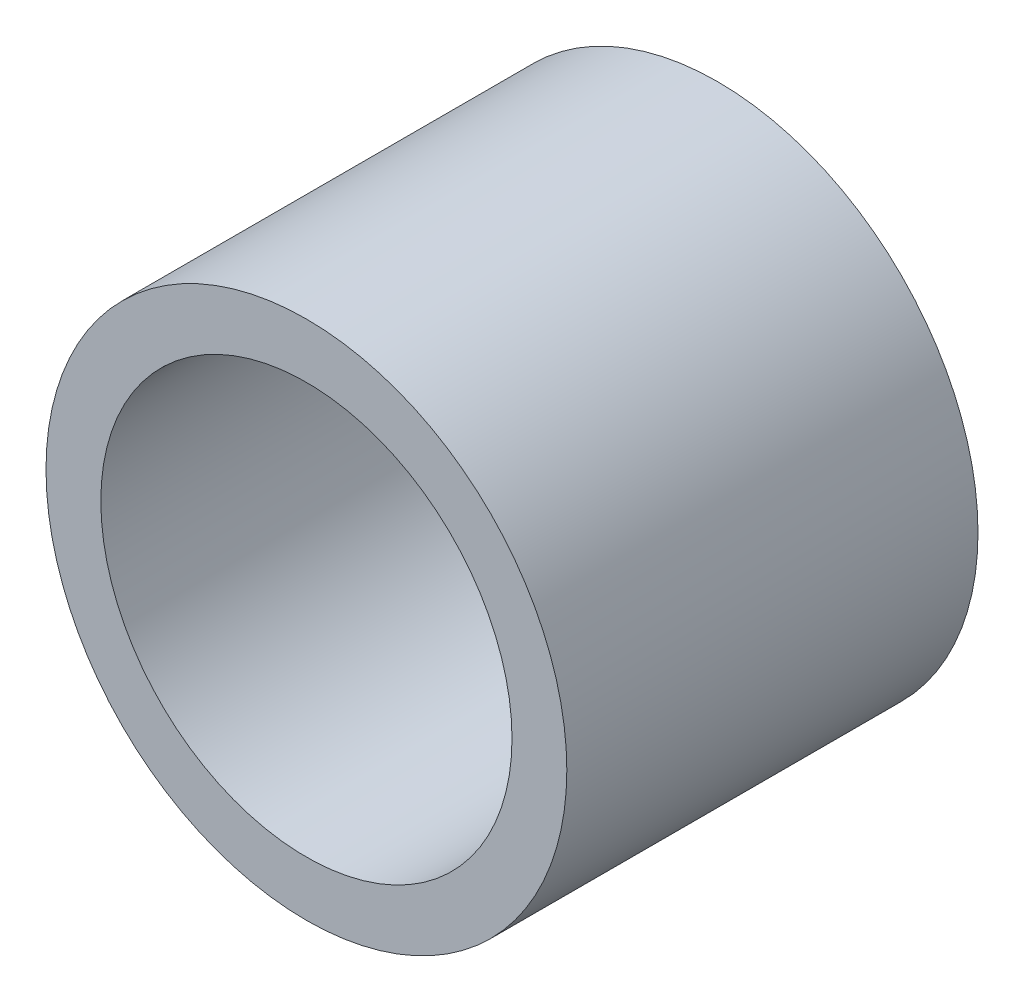
ISO-10303-21;
HEADER;
FILE_DESCRIPTION(('STEP AP214'),'2;1');
FILE_NAME('part.step','',(''),(''),'','','');
FILE_SCHEMA(('AUTOMOTIVE_DESIGN { 1 0 10303 214 1 1 1 1 }'));
ENDSEC;
DATA;
#1=APPLICATION_CONTEXT('core data for automotive mechanical design processes');
#2=APPLICATION_PROTOCOL_DEFINITION('international standard','automotive_design',2000,#1);
#3=PRODUCT_CONTEXT('',#1,'mechanical');
#4=PRODUCT('Part','Part','',(#3));
#5=PRODUCT_RELATED_PRODUCT_CATEGORY('part','',(#4));
#6=PRODUCT_DEFINITION_FORMATION('','',#4);
#7=PRODUCT_DEFINITION_CONTEXT('part definition',#1,'design');
#8=PRODUCT_DEFINITION('design','',#6,#7);
#9=PRODUCT_DEFINITION_SHAPE('','',#8);
#10=(LENGTH_UNIT() NAMED_UNIT(*) SI_UNIT(.MILLI.,.METRE.));
#11=(NAMED_UNIT(*) PLANE_ANGLE_UNIT() SI_UNIT($,.RADIAN.));
#12=(NAMED_UNIT(*) SI_UNIT($,.STERADIAN.) SOLID_ANGLE_UNIT());
#13=UNCERTAINTY_MEASURE_WITH_UNIT(LENGTH_MEASURE(1.E-05),#10,'distance_accuracy_value','');
#14=(GEOMETRIC_REPRESENTATION_CONTEXT(3) GLOBAL_UNCERTAINTY_ASSIGNED_CONTEXT((#13)) GLOBAL_UNIT_ASSIGNED_CONTEXT((#10,
#11,#12)) REPRESENTATION_CONTEXT('',''));
#15=CARTESIAN_POINT('',(0.,0.,0.));
#16=DIRECTION('',(0.,0.,1.));
#17=DIRECTION('',(1.,0.,0.));
#18=AXIS2_PLACEMENT_3D('',#15,#16,#17);
#19=CARTESIAN_POINT('',(0.,0.,7.5));
#20=DIRECTION('',(0.,0.,1.));
#21=DIRECTION('',(1.,0.,0.));
#22=AXIS2_PLACEMENT_3D('',#19,#20,#21);
#23=PLANE('',#22);
#24=CARTESIAN_POINT('',(0.,0.,7.5));
#25=DIRECTION('',(0.,0.,1.));
#26=DIRECTION('',(1.,0.,0.));
#27=AXIS2_PLACEMENT_3D('',#24,#25,#26);
#28=CIRCLE('',#27,9.5);
#29=CARTESIAN_POINT('',(9.5,0.,7.5));
#30=VERTEX_POINT('',#29);
#31=EDGE_CURVE('E10',#30,#30,#28,.T.);
#32=ORIENTED_EDGE('',*,*,#31,.T.);
#33=EDGE_LOOP('',(#32));
#34=FACE_BOUND('',#33,.T.);
#35=CARTESIAN_POINT('',(0.,0.,7.5));
#36=DIRECTION('',(0.,0.,1.));
#37=DIRECTION('',(1.,0.,0.));
#38=AXIS2_PLACEMENT_3D('',#35,#36,#37);
#39=CIRCLE('',#38,7.5);
#40=CARTESIAN_POINT('',(7.5,0.,7.5));
#41=VERTEX_POINT('',#40);
#42=EDGE_CURVE('E25',#41,#41,#39,.T.);
#43=ORIENTED_EDGE('',*,*,#42,.F.);
#44=EDGE_LOOP('',(#43));
#45=FACE_BOUND('',#44,.T.);
#46=ADVANCED_FACE('F14',(#34,#45),#23,.T.);
#47=CARTESIAN_POINT('',(0.,0.,-7.5));
#48=DIRECTION('',(0.,0.,1.));
#49=DIRECTION('',(1.,0.,0.));
#50=AXIS2_PLACEMENT_3D('',#47,#48,#49);
#51=PLANE('',#50);
#52=CARTESIAN_POINT('',(0.,0.,-7.5));
#53=DIRECTION('',(0.,0.,1.));
#54=DIRECTION('',(1.,0.,0.));
#55=AXIS2_PLACEMENT_3D('',#52,#53,#54);
#56=CIRCLE('',#55,9.5);
#57=CARTESIAN_POINT('',(9.5,0.,-7.5));
#58=VERTEX_POINT('',#57);
#59=EDGE_CURVE('E18',#58,#58,#56,.T.);
#60=ORIENTED_EDGE('',*,*,#59,.F.);
#61=EDGE_LOOP('',(#60));
#62=FACE_BOUND('',#61,.T.);
#63=CARTESIAN_POINT('',(0.,0.,-7.5));
#64=DIRECTION('',(0.,0.,1.));
#65=DIRECTION('',(1.,0.,0.));
#66=AXIS2_PLACEMENT_3D('',#63,#64,#65);
#67=CIRCLE('',#66,7.5);
#68=CARTESIAN_POINT('',(7.5,0.,-7.5));
#69=VERTEX_POINT('',#68);
#70=EDGE_CURVE('E27',#69,#69,#67,.T.);
#71=ORIENTED_EDGE('',*,*,#70,.T.);
#72=EDGE_LOOP('',(#71));
#73=FACE_BOUND('',#72,.T.);
#74=ADVANCED_FACE('F37',(#62,#73),#51,.F.);
#75=CARTESIAN_POINT('',(0.,0.,7.5));
#76=DIRECTION('',(0.,0.,-1.));
#77=DIRECTION('',(-1.,0.,0.));
#78=AXIS2_PLACEMENT_3D('',#75,#76,#77);
#79=CYLINDRICAL_SURFACE('',#78,9.5);
#80=ORIENTED_EDGE('',*,*,#31,.F.);
#81=EDGE_LOOP('',(#80));
#82=FACE_BOUND('',#81,.T.);
#83=ORIENTED_EDGE('',*,*,#59,.T.);
#84=EDGE_LOOP('',(#83));
#85=FACE_BOUND('',#84,.T.);
#86=ADVANCED_FACE('F16',(#82,#85),#79,.T.);
#87=CARTESIAN_POINT('',(0.,0.,7.5));
#88=DIRECTION('',(0.,0.,-1.));
#89=DIRECTION('',(-1.,0.,0.));
#90=AXIS2_PLACEMENT_3D('',#87,#88,#89);
#91=CYLINDRICAL_SURFACE('',#90,7.5);
#92=ORIENTED_EDGE('',*,*,#42,.T.);
#93=EDGE_LOOP('',(#92));
#94=FACE_BOUND('',#93,.T.);
#95=ORIENTED_EDGE('',*,*,#70,.F.);
#96=EDGE_LOOP('',(#95));
#97=FACE_BOUND('',#96,.T.);
#98=ADVANCED_FACE('F33',(#94,#97),#91,.F.);
#99=CLOSED_SHELL('',(#46,#74,#86,#98));
#100=MANIFOLD_SOLID_BREP('B1',#99);
#101=ADVANCED_BREP_SHAPE_REPRESENTATION('',(#18,#100),#14);
#102=SHAPE_DEFINITION_REPRESENTATION(#9,#101);
ENDSEC;
END-ISO-10303-21;
